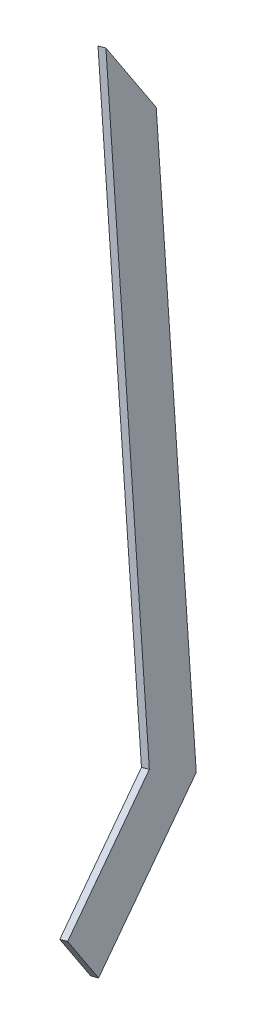
ISO-10303-21;
HEADER;
FILE_DESCRIPTION(('STEP AP214'),'2;1');
FILE_NAME('part.step','',(''),(''),'','','');
FILE_SCHEMA(('AUTOMOTIVE_DESIGN { 1 0 10303 214 1 1 1 1 }'));
ENDSEC;
DATA;
#1=APPLICATION_CONTEXT('core data for automotive mechanical design processes');
#2=APPLICATION_PROTOCOL_DEFINITION('international standard','automotive_design',2000,#1);
#3=PRODUCT_CONTEXT('',#1,'mechanical');
#4=PRODUCT('Part','Part','',(#3));
#5=PRODUCT_RELATED_PRODUCT_CATEGORY('part','',(#4));
#6=PRODUCT_DEFINITION_FORMATION('','',#4);
#7=PRODUCT_DEFINITION_CONTEXT('part definition',#1,'design');
#8=PRODUCT_DEFINITION('design','',#6,#7);
#9=PRODUCT_DEFINITION_SHAPE('','',#8);
#10=(LENGTH_UNIT() NAMED_UNIT(*) SI_UNIT(.MILLI.,.METRE.));
#11=(NAMED_UNIT(*) PLANE_ANGLE_UNIT() SI_UNIT($,.RADIAN.));
#12=(NAMED_UNIT(*) SI_UNIT($,.STERADIAN.) SOLID_ANGLE_UNIT());
#13=UNCERTAINTY_MEASURE_WITH_UNIT(LENGTH_MEASURE(1.E-05),#10,'distance_accuracy_value','');
#14=(GEOMETRIC_REPRESENTATION_CONTEXT(3) GLOBAL_UNCERTAINTY_ASSIGNED_CONTEXT((#13)) GLOBAL_UNIT_ASSIGNED_CONTEXT((#10,
#11,#12)) REPRESENTATION_CONTEXT('',''));
#15=CARTESIAN_POINT('',(0.,0.,0.));
#16=DIRECTION('',(0.,0.,1.));
#17=DIRECTION('',(1.,0.,0.));
#18=AXIS2_PLACEMENT_3D('',#15,#16,#17);
#19=CARTESIAN_POINT('',(52.254031226962,-693.715309644553,155.73570354391));
#20=DIRECTION('',(0.233089191441155,-0.534113538308831,0.812645160588882));
#21=DIRECTION('',(0.,-0.83566320194274,-0.549242216985191));
#22=AXIS2_PLACEMENT_3D('',#19,#20,#21);
#23=PLANE('',#22);
#24=DIRECTION('',(0.,-0.83566320194274,-0.549242216985191));
#25=VECTOR('',#24,1.);
#26=CARTESIAN_POINT('',(55.1713973094925,-693.331242371766,155.151351363736));
#27=LINE('',#26,#25);
#28=CARTESIAN_POINT('',(55.1713973094926,-672.439662323198,168.882406788366));
#29=VERTEX_POINT('',#28);
#30=CARTESIAN_POINT('',(55.1713973094925,-693.331242371766,155.151351363736));
#31=VERTEX_POINT('',#30);
#32=EDGE_CURVE('E118',#29,#31,#27,.T.);
#33=ORIENTED_EDGE('',*,*,#32,.F.);
#34=DIRECTION('',(0.972455360843524,0.128022424262425,-0.19478406005796));
#35=VECTOR('',#34,1.);
#36=CARTESIAN_POINT('',(52.254031226962,-672.823729595985,169.46675896854));
#37=LINE('',#36,#35);
#38=CARTESIAN_POINT('',(52.254031226962,-672.823729595985,169.46675896854));
#39=VERTEX_POINT('',#38);
#40=EDGE_CURVE('E11',#39,#29,#37,.T.);
#41=ORIENTED_EDGE('',*,*,#40,.F.);
#42=DIRECTION('',(0.,-0.83566320194274,-0.549242216985191));
#43=VECTOR('',#42,1.);
#44=CARTESIAN_POINT('',(52.254031226962,-693.715309644553,155.73570354391));
#45=LINE('',#44,#43);
#46=CARTESIAN_POINT('',(52.254031226962,-693.715309644553,155.73570354391));
#47=VERTEX_POINT('',#46);
#48=EDGE_CURVE('E132',#39,#47,#45,.T.);
#49=ORIENTED_EDGE('',*,*,#48,.T.);
#50=DIRECTION('',(0.972455360843524,0.128022424262425,-0.19478406005796));
#51=VECTOR('',#50,1.);
#52=CARTESIAN_POINT('',(52.254031226962,-693.715309644553,155.73570354391));
#53=LINE('',#52,#51);
#54=EDGE_CURVE('E36',#47,#31,#53,.T.);
#55=ORIENTED_EDGE('',*,*,#54,.T.);
#56=EDGE_LOOP('',(#33,#41,#49,#55));
#57=FACE_BOUND('',#56,.T.);
#58=ADVANCED_FACE('F33',(#57),#23,.T.);
#59=CARTESIAN_POINT('',(37.6859567618898,-639.441633451683,118.676436431735));
#60=DIRECTION('',(0.,0.835663201942739,0.549242216985192));
#61=DIRECTION('',(0.,-0.549242216985192,0.835663201942739));
#62=AXIS2_PLACEMENT_3D('',#59,#60,#61);
#63=PLANE('',#62);
#64=DIRECTION('',(0.233089191441155,-0.534113538308832,0.812645160588881));
#65=VECTOR('',#64,1.);
#66=CARTESIAN_POINT('',(40.6033228444204,-639.057566178896,118.092084251561));
#67=LINE('',#66,#65);
#68=CARTESIAN_POINT('',(40.6033228444204,-639.057566178896,118.092084251561));
#69=VERTEX_POINT('',#68);
#70=EDGE_CURVE('E130',#69,#29,#67,.T.);
#71=ORIENTED_EDGE('',*,*,#70,.F.);
#72=DIRECTION('',(0.972455360843524,0.128022424262425,-0.19478406005796));
#73=VECTOR('',#72,1.);
#74=CARTESIAN_POINT('',(37.6859567618898,-639.441633451683,118.676436431735));
#75=LINE('',#74,#73);
#76=CARTESIAN_POINT('',(37.6859567618898,-639.441633451683,118.676436431735));
#77=VERTEX_POINT('',#76);
#78=EDGE_CURVE('E42',#77,#69,#75,.T.);
#79=ORIENTED_EDGE('',*,*,#78,.F.);
#80=DIRECTION('',(0.233089191441155,-0.534113538308832,0.812645160588881));
#81=VECTOR('',#80,1.);
#82=CARTESIAN_POINT('',(37.6859567618898,-639.441633451683,118.676436431735));
#83=LINE('',#82,#81);
#84=EDGE_CURVE('E108',#77,#39,#83,.T.);
#85=ORIENTED_EDGE('',*,*,#84,.T.);
#86=ORIENTED_EDGE('',*,*,#40,.T.);
#87=EDGE_LOOP('',(#71,#79,#85,#86));
#88=FACE_BOUND('',#87,.T.);
#89=ADVANCED_FACE('F140',(#88),#63,.T.);
#90=CARTESIAN_POINT('',(1.31798370345287,-389.220613528398,101.568625912215));
#91=DIRECTION('',(0.183676789405127,0.0935984279491354,0.978520399030738));
#92=DIRECTION('',(0.982835014048648,0.,-0.184486680169585));
#93=AXIS2_PLACEMENT_3D('',#90,#91,#92);
#94=PLANE('',#93);
#95=DIRECTION('',(0.143504035485126,-0.987344718510927,0.0675055451652799));
#96=VECTOR('',#95,1.);
#97=CARTESIAN_POINT('',(4.23534978598344,-388.836546255611,100.984273732041));
#98=LINE('',#97,#96);
#99=CARTESIAN_POINT('',(4.23534978598344,-388.836546255611,100.984273732041));
#100=VERTEX_POINT('',#99);
#101=EDGE_CURVE('E95',#100,#69,#98,.T.);
#102=ORIENTED_EDGE('',*,*,#101,.F.);
#103=DIRECTION('',(0.972455360843524,0.128022424262425,-0.19478406005796));
#104=VECTOR('',#103,1.);
#105=CARTESIAN_POINT('',(1.31798370345287,-389.220613528398,101.568625912215));
#106=LINE('',#105,#104);
#107=CARTESIAN_POINT('',(1.31798370345287,-389.220613528398,101.568625912215));
#108=VERTEX_POINT('',#107);
#109=EDGE_CURVE('E90',#108,#100,#106,.T.);
#110=ORIENTED_EDGE('',*,*,#109,.F.);
#111=DIRECTION('',(0.143504035485126,-0.987344718510927,0.0675055451652799));
#112=VECTOR('',#111,1.);
#113=CARTESIAN_POINT('',(1.31798370345287,-389.220613528398,101.568625912215));
#114=LINE('',#113,#112);
#115=EDGE_CURVE('E93',#108,#77,#114,.T.);
#116=ORIENTED_EDGE('',*,*,#115,.T.);
#117=ORIENTED_EDGE('',*,*,#78,.T.);
#118=EDGE_LOOP('',(#102,#110,#116,#117));
#119=FACE_BOUND('',#118,.T.);
#120=ADVANCED_FACE('F92',(#119),#94,.T.);
#121=CARTESIAN_POINT('',(1.31798370345287,-389.220613528398,101.568625912215));
#122=DIRECTION('',(-0.233089191441155,0.534113538308831,-0.812645160588881));
#123=DIRECTION('',(0.,0.835663201942739,0.549242216985191));
#124=AXIS2_PLACEMENT_3D('',#121,#122,#123);
#125=PLANE('',#124);
#126=DIRECTION('',(0.,0.83566320194274,0.549242216985191));
#127=VECTOR('',#126,1.);
#128=CARTESIAN_POINT('',(4.23534978598344,-388.836546255611,100.984273732041));
#129=LINE('',#128,#127);
#130=CARTESIAN_POINT('',(4.2353497859834,-422.770097218041,78.6813426977957));
#131=VERTEX_POINT('',#130);
#132=EDGE_CURVE('E127',#131,#100,#129,.T.);
#133=ORIENTED_EDGE('',*,*,#132,.F.);
#134=DIRECTION('',(0.972455360843524,0.128022424262425,-0.19478406005796));
#135=VECTOR('',#134,1.);
#136=CARTESIAN_POINT('',(1.31798370345283,-423.154164490829,79.2656948779696));
#137=LINE('',#136,#135);
#138=CARTESIAN_POINT('',(1.31798370345283,-423.154164490829,79.2656948779696));
#139=VERTEX_POINT('',#138);
#140=EDGE_CURVE('E100',#139,#131,#137,.T.);
#141=ORIENTED_EDGE('',*,*,#140,.F.);
#142=DIRECTION('',(0.,0.83566320194274,0.549242216985191));
#143=VECTOR('',#142,1.);
#144=CARTESIAN_POINT('',(1.31798370345287,-389.220613528398,101.568625912215));
#145=LINE('',#144,#143);
#146=EDGE_CURVE('E106',#139,#108,#145,.T.);
#147=ORIENTED_EDGE('',*,*,#146,.T.);
#148=ORIENTED_EDGE('',*,*,#109,.T.);
#149=EDGE_LOOP('',(#133,#141,#147,#148));
#150=FACE_BOUND('',#149,.T.);
#151=ADVANCED_FACE('F110',(#150),#125,.T.);
#152=CARTESIAN_POINT('',(1.31798370345283,-423.154164490829,79.2656948779696));
#153=DIRECTION('',(-0.183676789405127,-0.0935984279491358,-0.978520399030738));
#154=DIRECTION('',(-0.982835014048648,0.,0.184486680169585));
#155=AXIS2_PLACEMENT_3D('',#152,#153,#154);
#156=PLANE('',#155);
#157=DIRECTION('',(-0.143504035485126,0.987344718510927,-0.0675055451652802));
#158=VECTOR('',#157,1.);
#159=CARTESIAN_POINT('',(4.2353497859834,-422.770097218041,78.6813426977957));
#160=LINE('',#159,#158);
#161=CARTESIAN_POINT('',(37.7611929767124,-653.436531761778,94.4521906329428));
#162=VERTEX_POINT('',#161);
#163=EDGE_CURVE('E124',#162,#131,#160,.T.);
#164=ORIENTED_EDGE('',*,*,#163,.F.);
#165=DIRECTION('',(0.972455360843524,0.128022424262425,-0.19478406005796));
#166=VECTOR('',#165,1.);
#167=CARTESIAN_POINT('',(34.8438268941819,-653.820599034566,95.0365428131167));
#168=LINE('',#167,#166);
#169=CARTESIAN_POINT('',(34.8438268941819,-653.820599034566,95.0365428131167));
#170=VERTEX_POINT('',#169);
#171=EDGE_CURVE('E135',#170,#162,#168,.T.);
#172=ORIENTED_EDGE('',*,*,#171,.F.);
#173=DIRECTION('',(-0.143504035485126,0.987344718510927,-0.0675055451652802));
#174=VECTOR('',#173,1.);
#175=CARTESIAN_POINT('',(1.31798370345283,-423.154164490829,79.2656948779696));
#176=LINE('',#175,#174);
#177=EDGE_CURVE('E111',#170,#139,#176,.T.);
#178=ORIENTED_EDGE('',*,*,#177,.T.);
#179=ORIENTED_EDGE('',*,*,#140,.T.);
#180=EDGE_LOOP('',(#164,#172,#178,#179));
#181=FACE_BOUND('',#180,.T.);
#182=ADVANCED_FACE('F153',(#181),#156,.T.);
#183=CARTESIAN_POINT('',(34.8438268941819,-653.820599034566,95.0365428131167));
#184=DIRECTION('',(0.,-0.835663201942739,-0.549242216985192));
#185=DIRECTION('',(0.,0.549242216985192,-0.835663201942739));
#186=AXIS2_PLACEMENT_3D('',#183,#184,#185);
#187=PLANE('',#186);
#188=DIRECTION('',(-0.233089191441155,0.534113538308832,-0.812645160588881));
#189=VECTOR('',#188,1.);
#190=CARTESIAN_POINT('',(37.7611929767124,-653.436531761778,94.4521906329428));
#191=LINE('',#190,#189);
#192=EDGE_CURVE('E121',#31,#162,#191,.T.);
#193=ORIENTED_EDGE('',*,*,#192,.F.);
#194=ORIENTED_EDGE('',*,*,#54,.F.);
#195=DIRECTION('',(-0.233089191441155,0.534113538308832,-0.812645160588881));
#196=VECTOR('',#195,1.);
#197=CARTESIAN_POINT('',(34.8438268941819,-653.820599034566,95.0365428131167));
#198=LINE('',#197,#196);
#199=EDGE_CURVE('E113',#47,#170,#198,.T.);
#200=ORIENTED_EDGE('',*,*,#199,.T.);
#201=ORIENTED_EDGE('',*,*,#171,.T.);
#202=EDGE_LOOP('',(#193,#194,#200,#201));
#203=FACE_BOUND('',#202,.T.);
#204=ADVANCED_FACE('F137',(#203),#187,.T.);
#205=CARTESIAN_POINT('',(-66.4490763028251,-8.74793042521501,13.3098354850328));
#206=DIRECTION('',(0.972455360843524,0.128022424262425,-0.194784060057961));
#207=DIRECTION('',(-0.196400183457513,0.,-0.980523823238301));
#208=AXIS2_PLACEMENT_3D('',#205,#206,#207);
#209=PLANE('',#208);
#210=ORIENTED_EDGE('',*,*,#48,.F.);
#211=ORIENTED_EDGE('',*,*,#84,.F.);
#212=ORIENTED_EDGE('',*,*,#115,.F.);
#213=ORIENTED_EDGE('',*,*,#146,.F.);
#214=ORIENTED_EDGE('',*,*,#177,.F.);
#215=ORIENTED_EDGE('',*,*,#199,.F.);
#216=EDGE_LOOP('',(#210,#211,#212,#213,#214,#215));
#217=FACE_BOUND('',#216,.T.);
#218=ADVANCED_FACE('F104',(#217),#209,.F.);
#219=CARTESIAN_POINT('',(-63.5317102202945,-8.36386315242774,12.7254833048589));
#220=DIRECTION('',(0.972455360843524,0.128022424262425,-0.194784060057961));
#221=DIRECTION('',(-0.196400183457513,0.,-0.980523823238301));
#222=AXIS2_PLACEMENT_3D('',#219,#220,#221);
#223=PLANE('',#222);
#224=ORIENTED_EDGE('',*,*,#32,.T.);
#225=ORIENTED_EDGE('',*,*,#192,.T.);
#226=ORIENTED_EDGE('',*,*,#163,.T.);
#227=ORIENTED_EDGE('',*,*,#132,.T.);
#228=ORIENTED_EDGE('',*,*,#101,.T.);
#229=ORIENTED_EDGE('',*,*,#70,.T.);
#230=EDGE_LOOP('',(#224,#225,#226,#227,#228,#229));
#231=FACE_BOUND('',#230,.T.);
#232=ADVANCED_FACE('F139',(#231),#223,.T.);
#233=CLOSED_SHELL('',(#58,#89,#120,#151,#182,#204,#218,#232));
#234=MANIFOLD_SOLID_BREP('B2',#233);
#235=ADVANCED_BREP_SHAPE_REPRESENTATION('',(#18,#234),#14);
#236=SHAPE_DEFINITION_REPRESENTATION(#9,#235);
ENDSEC;
END-ISO-10303-21;
